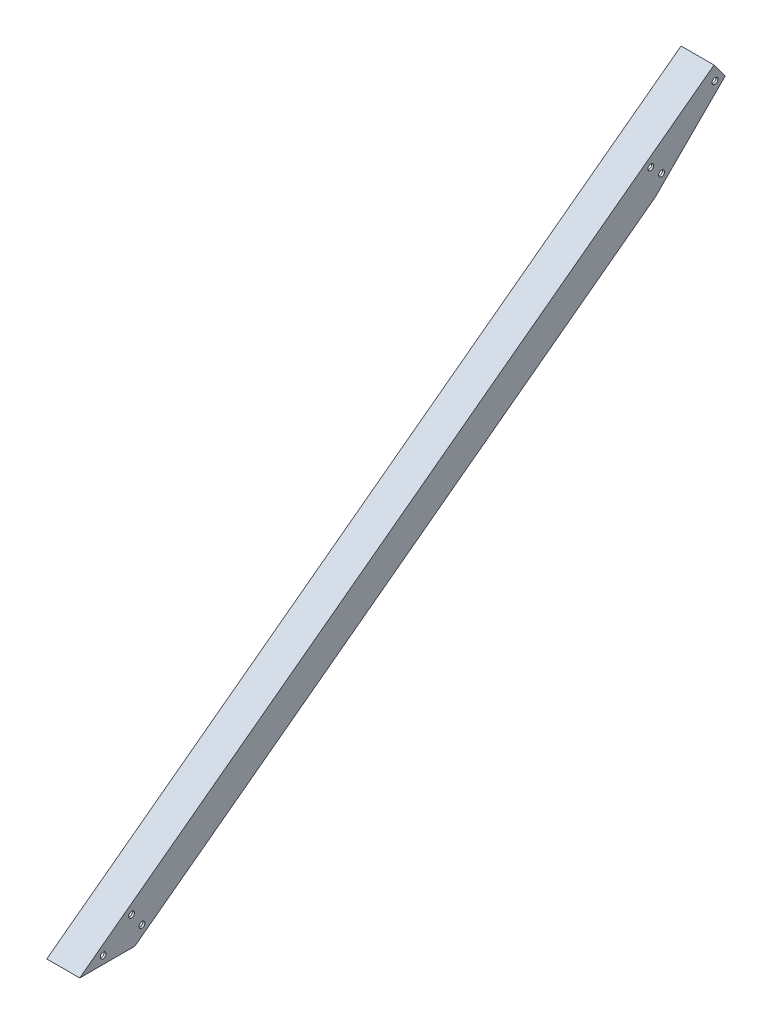
ISO-10303-21;
HEADER;
FILE_DESCRIPTION(('STEP AP214'),'2;1');
FILE_NAME('part.step','',(''),(''),'','','');
FILE_SCHEMA(('AUTOMOTIVE_DESIGN { 1 0 10303 214 1 1 1 1 }'));
ENDSEC;
DATA;
#1=APPLICATION_CONTEXT('core data for automotive mechanical design processes');
#2=APPLICATION_PROTOCOL_DEFINITION('international standard','automotive_design',2000,#1);
#3=PRODUCT_CONTEXT('',#1,'mechanical');
#4=PRODUCT('Part','Part','',(#3));
#5=PRODUCT_RELATED_PRODUCT_CATEGORY('part','',(#4));
#6=PRODUCT_DEFINITION_FORMATION('','',#4);
#7=PRODUCT_DEFINITION_CONTEXT('part definition',#1,'design');
#8=PRODUCT_DEFINITION('design','',#6,#7);
#9=PRODUCT_DEFINITION_SHAPE('','',#8);
#10=(LENGTH_UNIT() NAMED_UNIT(*) SI_UNIT(.MILLI.,.METRE.));
#11=(NAMED_UNIT(*) PLANE_ANGLE_UNIT() SI_UNIT($,.RADIAN.));
#12=(NAMED_UNIT(*) SI_UNIT($,.STERADIAN.) SOLID_ANGLE_UNIT());
#13=UNCERTAINTY_MEASURE_WITH_UNIT(LENGTH_MEASURE(1.E-05),#10,'distance_accuracy_value','');
#14=(GEOMETRIC_REPRESENTATION_CONTEXT(3) GLOBAL_UNCERTAINTY_ASSIGNED_CONTEXT((#13)) GLOBAL_UNIT_ASSIGNED_CONTEXT((#10,
#11,#12)) REPRESENTATION_CONTEXT('',''));
#15=CARTESIAN_POINT('',(0.,0.,0.));
#16=DIRECTION('',(0.,0.,1.));
#17=DIRECTION('',(1.,0.,0.));
#18=AXIS2_PLACEMENT_3D('',#15,#16,#17);
#19=CARTESIAN_POINT('',(114.3,-46.6394877578616,-46.6394877578611));
#20=DIRECTION('',(0.,0.707106781186551,0.707106781186544));
#21=DIRECTION('',(0.,-0.707106781186544,0.707106781186551));
#22=AXIS2_PLACEMENT_3D('',#19,#20,#21);
#23=PLANE('',#22);
#24=DIRECTION('',(0.,0.707106781186544,-0.707106781186551));
#25=VECTOR('',#24,1.);
#26=CARTESIAN_POINT('',(90.4875,-46.6394877578616,-46.6394877578611));
#27=LINE('',#26,#25);
#28=CARTESIAN_POINT('',(90.4875,332.446060333932,-425.725035849659));
#29=VERTEX_POINT('',#28);
#30=CARTESIAN_POINT('',(90.4875,378.473402548094,-471.752378063822));
#31=VERTEX_POINT('',#30);
#32=EDGE_CURVE('E131',#29,#31,#27,.T.);
#33=ORIENTED_EDGE('',*,*,#32,.F.);
#34=DIRECTION('',(1.,0.,0.));
#35=VECTOR('',#34,1.);
#36=CARTESIAN_POINT('',(114.3,332.446060333932,-425.725035849658));
#37=LINE('',#36,#35);
#38=CARTESIAN_POINT('',(112.7125,332.446060333928,-425.725035849653));
#39=VERTEX_POINT('',#38);
#40=EDGE_CURVE('E153',#29,#39,#37,.T.);
#41=ORIENTED_EDGE('',*,*,#40,.T.);
#42=DIRECTION('',(0.,0.707106781186544,-0.707106781186551));
#43=VECTOR('',#42,1.);
#44=CARTESIAN_POINT('',(112.7125,-46.6394877578616,-46.6394877578611));
#45=LINE('',#44,#43);
#46=CARTESIAN_POINT('',(112.7125,378.473402548094,-471.752378063822));
#47=VERTEX_POINT('',#46);
#48=EDGE_CURVE('E123',#39,#47,#45,.T.);
#49=ORIENTED_EDGE('',*,*,#48,.T.);
#50=DIRECTION('',(-1.,0.,0.));
#51=VECTOR('',#50,1.);
#52=CARTESIAN_POINT('',(114.3,378.473402548094,-471.752378063821));
#53=LINE('',#52,#51);
#54=CARTESIAN_POINT('',(114.3,378.473402548094,-471.752378063821));
#55=VERTEX_POINT('',#54);
#56=EDGE_CURVE('E192',#55,#47,#53,.T.);
#57=ORIENTED_EDGE('',*,*,#56,.F.);
#58=DIRECTION('',(0.,0.707106781186544,-0.707106781186551));
#59=VECTOR('',#58,1.);
#60=CARTESIAN_POINT('',(114.3,-46.6394877578616,-46.6394877578611));
#61=LINE('',#60,#59);
#62=CARTESIAN_POINT('',(114.3,324.631526442067,-417.910501957793));
#63=VERTEX_POINT('',#62);
#64=EDGE_CURVE('E158',#63,#55,#61,.T.);
#65=ORIENTED_EDGE('',*,*,#64,.F.);
#66=DIRECTION('',(-1.,0.,0.));
#67=VECTOR('',#66,1.);
#68=CARTESIAN_POINT('',(114.3,324.631526442067,-417.910501957793));
#69=LINE('',#68,#67);
#70=CARTESIAN_POINT('',(88.9,324.631526442067,-417.910501957793));
#71=VERTEX_POINT('',#70);
#72=EDGE_CURVE('E170',#63,#71,#69,.T.);
#73=ORIENTED_EDGE('',*,*,#72,.T.);
#74=DIRECTION('',(0.,0.707106781186544,-0.707106781186551));
#75=VECTOR('',#74,1.);
#76=CARTESIAN_POINT('',(88.9,-46.6394877578616,-46.6394877578611));
#77=LINE('',#76,#75);
#78=CARTESIAN_POINT('',(88.9,378.473402548094,-471.752378063821));
#79=VERTEX_POINT('',#78);
#80=EDGE_CURVE('E157',#71,#79,#77,.T.);
#81=ORIENTED_EDGE('',*,*,#80,.T.);
#82=EDGE_CURVE('E191',#31,#79,#53,.T.);
#83=ORIENTED_EDGE('',*,*,#82,.F.);
#84=EDGE_LOOP('',(#33,#41,#49,#57,#65,#73,#81,#83));
#85=FACE_BOUND('',#84,.T.);
#86=ADVANCED_FACE('F41',(#85),#23,.F.);
#87=CARTESIAN_POINT('',(114.3,361.575951818807,-484.366205698519));
#88=DIRECTION('',(0.,-0.59819984437787,0.801346957432479));
#89=DIRECTION('',(0.,-0.801346957432479,-0.59819984437787));
#90=AXIS2_PLACEMENT_3D('',#87,#88,#89);
#91=PLANE('',#90);
#92=DIRECTION('',(0.,-0.80134695743248,-0.59819984437787));
#93=VECTOR('',#92,1.);
#94=CARTESIAN_POINT('',(90.4875,361.575951818806,-484.366205698519));
#95=LINE('',#94,#93);
#96=CARTESIAN_POINT('',(90.4875,388.790486837825,-464.05074750379));
#97=VERTEX_POINT('',#96);
#98=EDGE_CURVE('E127',#97,#31,#95,.T.);
#99=ORIENTED_EDGE('',*,*,#98,.T.);
#100=ORIENTED_EDGE('',*,*,#82,.T.);
#101=DIRECTION('',(0.,0.801346957432479,0.59819984437787));
#102=VECTOR('',#101,1.);
#103=CARTESIAN_POINT('',(88.9,361.575951818807,-484.366205698519));
#104=LINE('',#103,#102);
#105=CARTESIAN_POINT('',(88.9,390.062625132749,-463.10110525084));
#106=VERTEX_POINT('',#105);
#107=EDGE_CURVE('E173',#79,#106,#104,.T.);
#108=ORIENTED_EDGE('',*,*,#107,.T.);
#109=DIRECTION('',(-1.,0.,0.));
#110=VECTOR('',#109,1.);
#111=CARTESIAN_POINT('',(114.3,390.062625132749,-463.10110525084));
#112=LINE('',#111,#110);
#113=CARTESIAN_POINT('',(114.3,390.062625132749,-463.10110525084));
#114=VERTEX_POINT('',#113);
#115=EDGE_CURVE('E188',#114,#106,#112,.T.);
#116=ORIENTED_EDGE('',*,*,#115,.F.);
#117=DIRECTION('',(0.,0.801346957432479,0.59819984437787));
#118=VECTOR('',#117,1.);
#119=CARTESIAN_POINT('',(114.3,361.575951818807,-484.366205698519));
#120=LINE('',#119,#118);
#121=EDGE_CURVE('E161',#55,#114,#120,.T.);
#122=ORIENTED_EDGE('',*,*,#121,.F.);
#123=ORIENTED_EDGE('',*,*,#56,.T.);
#124=DIRECTION('',(0.,-0.80134695743248,-0.59819984437787));
#125=VECTOR('',#124,1.);
#126=CARTESIAN_POINT('',(112.7125,361.575951818806,-484.366205698519));
#127=LINE('',#126,#125);
#128=CARTESIAN_POINT('',(112.7125,388.790486837825,-464.05074750379));
#129=VERTEX_POINT('',#128);
#130=EDGE_CURVE('E135',#129,#47,#127,.T.);
#131=ORIENTED_EDGE('',*,*,#130,.F.);
#132=DIRECTION('',(-1.,0.,0.));
#133=VECTOR('',#132,1.);
#134=CARTESIAN_POINT('',(-4.19414547070682E-13,388.790486837825,-464.05074750379));
#135=LINE('',#134,#133);
#136=EDGE_CURVE('E57',#129,#97,#135,.T.);
#137=ORIENTED_EDGE('',*,*,#136,.T.);
#138=EDGE_LOOP('',(#99,#100,#108,#116,#122,#123,#131,#137));
#139=FACE_BOUND('',#138,.T.);
#140=ADVANCED_FACE('F138',(#139),#91,.F.);
#141=CARTESIAN_POINT('',(114.3,25.4000000000001,0.));
#142=DIRECTION('',(0.,1.,0.));
#143=DIRECTION('',(0.,0.,1.));
#144=AXIS2_PLACEMENT_3D('',#141,#142,#143);
#145=PLANE('',#144);
#146=DIRECTION('',(0.,0.,-1.));
#147=VECTOR('',#146,1.);
#148=CARTESIAN_POINT('',(88.9,25.4000000000001,0.));
#149=LINE('',#148,#147);
#150=CARTESIAN_POINT('',(88.9,25.4,25.4));
#151=VERTEX_POINT('',#150);
#152=CARTESIAN_POINT('',(88.9,25.4000000000001,-17.0607265259594));
#153=VERTEX_POINT('',#152);
#154=EDGE_CURVE('E177',#151,#153,#149,.T.);
#155=ORIENTED_EDGE('',*,*,#154,.T.);
#156=DIRECTION('',(-1.,0.,0.));
#157=VECTOR('',#156,1.);
#158=CARTESIAN_POINT('',(114.3,25.4000000000001,-17.0607265259594));
#159=LINE('',#158,#157);
#160=CARTESIAN_POINT('',(114.3,25.4000000000001,-17.0607265259594));
#161=VERTEX_POINT('',#160);
#162=EDGE_CURVE('E182',#161,#153,#159,.T.);
#163=ORIENTED_EDGE('',*,*,#162,.F.);
#164=DIRECTION('',(0.,0.,-1.));
#165=VECTOR('',#164,1.);
#166=CARTESIAN_POINT('',(114.3,25.4000000000001,0.));
#167=LINE('',#166,#165);
#168=CARTESIAN_POINT('',(114.3,25.4,25.4));
#169=VERTEX_POINT('',#168);
#170=EDGE_CURVE('E166',#169,#161,#167,.T.);
#171=ORIENTED_EDGE('',*,*,#170,.F.);
#172=DIRECTION('',(-1.,0.,0.));
#173=VECTOR('',#172,1.);
#174=CARTESIAN_POINT('',(114.3,25.4,25.4));
#175=LINE('',#174,#173);
#176=EDGE_CURVE('E185',#169,#151,#175,.T.);
#177=ORIENTED_EDGE('',*,*,#176,.T.);
#178=EDGE_LOOP('',(#155,#163,#171,#177));
#179=FACE_BOUND('',#178,.T.);
#180=DIRECTION('',(-1.,0.,0.));
#181=VECTOR('',#180,1.);
#182=CARTESIAN_POINT('',(114.3,25.4,22.746204592126));
#183=LINE('',#182,#181);
#184=CARTESIAN_POINT('',(112.7125,25.4,22.7462045921258));
#185=VERTEX_POINT('',#184);
#186=CARTESIAN_POINT('',(90.4875,25.4,22.7462045921258));
#187=VERTEX_POINT('',#186);
#188=EDGE_CURVE('E11',#185,#187,#183,.T.);
#189=ORIENTED_EDGE('',*,*,#188,.F.);
#190=DIRECTION('',(0.,0.,-1.));
#191=VECTOR('',#190,1.);
#192=CARTESIAN_POINT('',(112.7125,25.4000000000001,0.));
#193=LINE('',#192,#191);
#194=CARTESIAN_POINT('',(112.7125,25.4000000000002,-14.4069311180883));
#195=VERTEX_POINT('',#194);
#196=EDGE_CURVE('E194',#185,#195,#193,.T.);
#197=ORIENTED_EDGE('',*,*,#196,.T.);
#198=DIRECTION('',(-1.,0.,0.));
#199=VECTOR('',#198,1.);
#200=CARTESIAN_POINT('',(114.3,25.4000000000001,-14.4069311180882));
#201=LINE('',#200,#199);
#202=CARTESIAN_POINT('',(90.4875,25.4000000000004,-14.4069311180886));
#203=VERTEX_POINT('',#202);
#204=EDGE_CURVE('E197',#195,#203,#201,.T.);
#205=ORIENTED_EDGE('',*,*,#204,.T.);
#206=DIRECTION('',(0.,0.,-1.));
#207=VECTOR('',#206,1.);
#208=CARTESIAN_POINT('',(90.4875,25.4000000000001,0.));
#209=LINE('',#208,#207);
#210=EDGE_CURVE('E49',#187,#203,#209,.T.);
#211=ORIENTED_EDGE('',*,*,#210,.F.);
#212=EDGE_LOOP('',(#189,#197,#205,#211));
#213=FACE_BOUND('',#212,.T.);
#214=ADVANCED_FACE('F273',(#179,#213),#145,.F.);
#215=CARTESIAN_POINT('',(114.3,28.486673313943,21.2651004476793));
#216=DIRECTION('',(0.,-0.80134695743248,-0.598199844377869));
#217=DIRECTION('',(0.,0.598199844377869,-0.80134695743248));
#218=AXIS2_PLACEMENT_3D('',#215,#216,#217);
#219=PLANE('',#218);
#220=DIRECTION('',(0.,-0.598199844377869,0.80134695743248));
#221=VECTOR('',#220,1.);
#222=CARTESIAN_POINT('',(88.9,28.486673313943,21.2651004476793));
#223=LINE('',#222,#221);
#224=EDGE_CURVE('E175',#106,#151,#223,.T.);
#225=ORIENTED_EDGE('',*,*,#224,.T.);
#226=ORIENTED_EDGE('',*,*,#176,.F.);
#227=DIRECTION('',(0.,-0.598199844377869,0.80134695743248));
#228=VECTOR('',#227,1.);
#229=CARTESIAN_POINT('',(114.3,28.486673313943,21.2651004476793));
#230=LINE('',#229,#228);
#231=EDGE_CURVE('E164',#114,#169,#230,.T.);
#232=ORIENTED_EDGE('',*,*,#231,.F.);
#233=ORIENTED_EDGE('',*,*,#115,.T.);
#234=EDGE_LOOP('',(#225,#226,#232,#233));
#235=FACE_BOUND('',#234,.T.);
#236=ADVANCED_FACE('F284',(#235),#219,.F.);
#237=CARTESIAN_POINT('',(114.3,8.13246059515802,6.07082440048146));
#238=DIRECTION('',(0.,0.80134695743248,0.598199844377869));
#239=DIRECTION('',(0.,-0.598199844377869,0.80134695743248));
#240=AXIS2_PLACEMENT_3D('',#237,#238,#239);
#241=PLANE('',#240);
#242=DIRECTION('',(0.,0.598199844377869,-0.80134695743248));
#243=VECTOR('',#242,1.);
#244=CARTESIAN_POINT('',(88.9,8.13246059515802,6.07082440048146));
#245=LINE('',#244,#243);
#246=EDGE_CURVE('E162',#153,#71,#245,.T.);
#247=ORIENTED_EDGE('',*,*,#246,.T.);
#248=ORIENTED_EDGE('',*,*,#72,.F.);
#249=DIRECTION('',(0.,0.598199844377869,-0.80134695743248));
#250=VECTOR('',#249,1.);
#251=CARTESIAN_POINT('',(114.3,8.13246059515802,6.07082440048146));
#252=LINE('',#251,#250);
#253=EDGE_CURVE('E168',#161,#63,#252,.T.);
#254=ORIENTED_EDGE('',*,*,#253,.F.);
#255=ORIENTED_EDGE('',*,*,#162,.T.);
#256=EDGE_LOOP('',(#247,#248,#254,#255));
#257=FACE_BOUND('',#256,.T.);
#258=ADVANCED_FACE('F305',(#257),#241,.F.);
#259=CARTESIAN_POINT('',(114.3,0.,0.));
#260=DIRECTION('',(1.,0.,0.));
#261=DIRECTION('',(0.,0.,-1.));
#262=AXIS2_PLACEMENT_3D('',#259,#260,#261);
#263=PLANE('',#262);
#264=CARTESIAN_POINT('',(114.3,379.044769229918,-463.838463371403));
#265=DIRECTION('',(1.,0.,0.));
#266=DIRECTION('',(0.,0.,-1.));
#267=AXIS2_PLACEMENT_3D('',#264,#265,#266);
#268=CIRCLE('',#267,2.24999999999996);
#269=CARTESIAN_POINT('',(114.3,379.044769229918,-466.088463371403));
#270=VERTEX_POINT('',#269);
#271=EDGE_CURVE('E404',#270,#270,#268,.T.);
#272=ORIENTED_EDGE('',*,*,#271,.F.);
#273=EDGE_LOOP('',(#272));
#274=FACE_BOUND('',#273,.T.);
#275=CARTESIAN_POINT('',(114.3,346.244088463268,-414.432000247125));
#276=DIRECTION('',(1.,0.,0.));
#277=DIRECTION('',(0.,0.,-1.));
#278=AXIS2_PLACEMENT_3D('',#275,#276,#277);
#279=CIRCLE('',#278,2.25000000000001);
#280=CARTESIAN_POINT('',(114.3,346.244088463268,-416.682000247125));
#281=VERTEX_POINT('',#280);
#282=EDGE_CURVE('E402',#281,#281,#279,.T.);
#283=ORIENTED_EDGE('',*,*,#282,.F.);
#284=EDGE_LOOP('',(#283));
#285=FACE_BOUND('',#284,.T.);
#286=CARTESIAN_POINT('',(114.3,337.941197284456,-422.734891425937));
#287=DIRECTION('',(1.,0.,0.));
#288=DIRECTION('',(0.,0.,-1.));
#289=AXIS2_PLACEMENT_3D('',#286,#287,#288);
#290=CIRCLE('',#289,2.24999999999996);
#291=CARTESIAN_POINT('',(114.3,337.941197284456,-424.984891425937));
#292=VERTEX_POINT('',#291);
#293=EDGE_CURVE('E397',#292,#292,#290,.T.);
#294=ORIENTED_EDGE('',*,*,#293,.F.);
#295=EDGE_LOOP('',(#294));
#296=FACE_BOUND('',#295,.T.);
#297=CARTESIAN_POINT('',(114.3,31.4,7.33232270758054));
#298=DIRECTION('',(1.,0.,0.));
#299=DIRECTION('',(0.,0.,-1.));
#300=AXIS2_PLACEMENT_3D('',#297,#298,#299);
#301=CIRCLE('',#300,2.25);
#302=CARTESIAN_POINT('',(114.3,31.4,5.08232270758054));
#303=VERTEX_POINT('',#302);
#304=EDGE_CURVE('E378',#303,#303,#301,.T.);
#305=ORIENTED_EDGE('',*,*,#304,.F.);
#306=EDGE_LOOP('',(#305));
#307=FACE_BOUND('',#306,.T.);
#308=CARTESIAN_POINT('',(114.3,47.6821192037804,-14.4791618775951));
#309=DIRECTION('',(1.,0.,0.));
#310=DIRECTION('',(0.,0.,-1.));
#311=AXIS2_PLACEMENT_3D('',#308,#309,#310);
#312=CIRCLE('',#311,2.25);
#313=CARTESIAN_POINT('',(114.3,47.6821192037804,-16.7291618775951));
#314=VERTEX_POINT('',#313);
#315=EDGE_CURVE('E393',#314,#314,#312,.T.);
#316=ORIENTED_EDGE('',*,*,#315,.F.);
#317=EDGE_LOOP('',(#316));
#318=FACE_BOUND('',#317,.T.);
#319=CARTESIAN_POINT('',(114.3,36.9440699741851,-22.4950397922586));
#320=DIRECTION('',(1.,0.,0.));
#321=DIRECTION('',(0.,0.,-1.));
#322=AXIS2_PLACEMENT_3D('',#319,#320,#321);
#323=CIRCLE('',#322,2.25);
#324=CARTESIAN_POINT('',(114.3,36.9440699741851,-24.7450397922586));
#325=VERTEX_POINT('',#324);
#326=EDGE_CURVE('E205',#325,#325,#323,.T.);
#327=ORIENTED_EDGE('',*,*,#326,.F.);
#328=EDGE_LOOP('',(#327));
#329=FACE_BOUND('',#328,.T.);
#330=ORIENTED_EDGE('',*,*,#64,.T.);
#331=ORIENTED_EDGE('',*,*,#121,.T.);
#332=ORIENTED_EDGE('',*,*,#231,.T.);
#333=ORIENTED_EDGE('',*,*,#170,.T.);
#334=ORIENTED_EDGE('',*,*,#253,.T.);
#335=EDGE_LOOP('',(#330,#331,#332,#333,#334));
#336=FACE_BOUND('',#335,.T.);
#337=ADVANCED_FACE('F292',(#274,#285,#296,#307,#318,#329,#336),#263,.T.);
#338=CARTESIAN_POINT('',(88.9,0.,0.));
#339=DIRECTION('',(1.,0.,0.));
#340=DIRECTION('',(0.,0.,-1.));
#341=AXIS2_PLACEMENT_3D('',#338,#339,#340);
#342=PLANE('',#341);
#343=CARTESIAN_POINT('',(88.9,379.044769229918,-463.838463371403));
#344=DIRECTION('',(1.,0.,0.));
#345=DIRECTION('',(0.,0.,-1.));
#346=AXIS2_PLACEMENT_3D('',#343,#344,#345);
#347=CIRCLE('',#346,2.24999999999996);
#348=CARTESIAN_POINT('',(88.9,379.044769229918,-466.088463371403));
#349=VERTEX_POINT('',#348);
#350=EDGE_CURVE('E140',#349,#349,#347,.T.);
#351=ORIENTED_EDGE('',*,*,#350,.T.);
#352=EDGE_LOOP('',(#351));
#353=FACE_BOUND('',#352,.T.);
#354=CARTESIAN_POINT('',(88.9,346.244088463268,-414.432000247125));
#355=DIRECTION('',(1.,0.,0.));
#356=DIRECTION('',(0.,0.,-1.));
#357=AXIS2_PLACEMENT_3D('',#354,#355,#356);
#358=CIRCLE('',#357,2.25000000000001);
#359=CARTESIAN_POINT('',(88.9,346.244088463268,-416.682000247125));
#360=VERTEX_POINT('',#359);
#361=EDGE_CURVE('E227',#360,#360,#358,.T.);
#362=ORIENTED_EDGE('',*,*,#361,.T.);
#363=EDGE_LOOP('',(#362));
#364=FACE_BOUND('',#363,.T.);
#365=CARTESIAN_POINT('',(88.9,337.941197284456,-422.734891425937));
#366=DIRECTION('',(1.,0.,0.));
#367=DIRECTION('',(0.,0.,-1.));
#368=AXIS2_PLACEMENT_3D('',#365,#366,#367);
#369=CIRCLE('',#368,2.24999999999996);
#370=CARTESIAN_POINT('',(88.9,337.941197284456,-424.984891425937));
#371=VERTEX_POINT('',#370);
#372=EDGE_CURVE('E223',#371,#371,#369,.T.);
#373=ORIENTED_EDGE('',*,*,#372,.T.);
#374=EDGE_LOOP('',(#373));
#375=FACE_BOUND('',#374,.T.);
#376=CARTESIAN_POINT('',(88.9,31.4,7.33232270758054));
#377=DIRECTION('',(1.,0.,0.));
#378=DIRECTION('',(0.,0.,-1.));
#379=AXIS2_PLACEMENT_3D('',#376,#377,#378);
#380=CIRCLE('',#379,2.25);
#381=CARTESIAN_POINT('',(88.9,31.4,5.08232270758054));
#382=VERTEX_POINT('',#381);
#383=EDGE_CURVE('E219',#382,#382,#380,.T.);
#384=ORIENTED_EDGE('',*,*,#383,.T.);
#385=EDGE_LOOP('',(#384));
#386=FACE_BOUND('',#385,.T.);
#387=CARTESIAN_POINT('',(88.9,47.6821192037804,-14.4791618775951));
#388=DIRECTION('',(1.,0.,0.));
#389=DIRECTION('',(0.,0.,-1.));
#390=AXIS2_PLACEMENT_3D('',#387,#388,#389);
#391=CIRCLE('',#390,2.25);
#392=CARTESIAN_POINT('',(88.9,47.6821192037804,-16.7291618775951));
#393=VERTEX_POINT('',#392);
#394=EDGE_CURVE('E215',#393,#393,#391,.T.);
#395=ORIENTED_EDGE('',*,*,#394,.T.);
#396=EDGE_LOOP('',(#395));
#397=FACE_BOUND('',#396,.T.);
#398=CARTESIAN_POINT('',(88.9,36.9440699741851,-22.4950397922586));
#399=DIRECTION('',(1.,0.,0.));
#400=DIRECTION('',(0.,0.,-1.));
#401=AXIS2_PLACEMENT_3D('',#398,#399,#400);
#402=CIRCLE('',#401,2.25);
#403=CARTESIAN_POINT('',(88.9,36.9440699741851,-24.7450397922586));
#404=VERTEX_POINT('',#403);
#405=EDGE_CURVE('E210',#404,#404,#402,.T.);
#406=ORIENTED_EDGE('',*,*,#405,.T.);
#407=EDGE_LOOP('',(#406));
#408=FACE_BOUND('',#407,.T.);
#409=ORIENTED_EDGE('',*,*,#80,.F.);
#410=ORIENTED_EDGE('',*,*,#246,.F.);
#411=ORIENTED_EDGE('',*,*,#154,.F.);
#412=ORIENTED_EDGE('',*,*,#224,.F.);
#413=ORIENTED_EDGE('',*,*,#107,.F.);
#414=EDGE_LOOP('',(#409,#410,#411,#412,#413));
#415=FACE_BOUND('',#414,.T.);
#416=ADVANCED_FACE('F279',(#353,#364,#375,#386,#397,#408,#415),#342,.F.);
#417=CARTESIAN_POINT('',(-4.19414547070682E-13,-807.609201917915,1138.64316736117));
#418=DIRECTION('',(0.,-0.80134695743248,-0.59819984437787));
#419=DIRECTION('',(0.,0.59819984437787,-0.80134695743248));
#420=AXIS2_PLACEMENT_3D('',#417,#418,#419);
#421=PLANE('',#420);
#422=ORIENTED_EDGE('',*,*,#188,.T.);
#423=DIRECTION('',(0.,0.59819984437787,-0.80134695743248));
#424=VECTOR('',#423,1.);
#425=CARTESIAN_POINT('',(90.4875,-807.609201917915,1138.64316736117));
#426=LINE('',#425,#424);
#427=EDGE_CURVE('E117',#187,#97,#426,.T.);
#428=ORIENTED_EDGE('',*,*,#427,.T.);
#429=ORIENTED_EDGE('',*,*,#136,.F.);
#430=DIRECTION('',(0.,0.59819984437787,-0.80134695743248));
#431=VECTOR('',#430,1.);
#432=CARTESIAN_POINT('',(112.7125,-807.609201917915,1138.64316736117));
#433=LINE('',#432,#431);
#434=EDGE_CURVE('E134',#185,#129,#433,.T.);
#435=ORIENTED_EDGE('',*,*,#434,.F.);
#436=EDGE_LOOP('',(#422,#428,#429,#435));
#437=FACE_BOUND('',#436,.T.);
#438=ADVANCED_FACE('F119',(#437),#421,.T.);
#439=CARTESIAN_POINT('',(90.4875,-834.823736936934,1118.32770916644));
#440=DIRECTION('',(1.,0.,0.));
#441=DIRECTION('',(0.,0.,-1.));
#442=AXIS2_PLACEMENT_3D('',#439,#440,#441);
#443=PLANE('',#442);
#444=CARTESIAN_POINT('',(90.4875000000001,379.044769229918,-463.838463371403));
#445=DIRECTION('',(1.,0.,0.));
#446=DIRECTION('',(0.,0.,-1.));
#447=AXIS2_PLACEMENT_3D('',#444,#445,#446);
#448=CIRCLE('',#447,2.24999999999996);
#449=CARTESIAN_POINT('',(90.4875000000001,379.044769229918,-466.088463371403));
#450=VERTEX_POINT('',#449);
#451=EDGE_CURVE('E144',#450,#450,#448,.T.);
#452=ORIENTED_EDGE('',*,*,#451,.F.);
#453=EDGE_LOOP('',(#452));
#454=FACE_BOUND('',#453,.T.);
#455=CARTESIAN_POINT('',(90.4875000000001,346.244088463268,-414.432000247125));
#456=DIRECTION('',(1.,0.,0.));
#457=DIRECTION('',(0.,0.,-1.));
#458=AXIS2_PLACEMENT_3D('',#455,#456,#457);
#459=CIRCLE('',#458,2.25000000000001);
#460=CARTESIAN_POINT('',(90.4875000000001,346.244088463268,-416.682000247125));
#461=VERTEX_POINT('',#460);
#462=EDGE_CURVE('E222',#461,#461,#459,.T.);
#463=ORIENTED_EDGE('',*,*,#462,.F.);
#464=EDGE_LOOP('',(#463));
#465=FACE_BOUND('',#464,.T.);
#466=CARTESIAN_POINT('',(90.4875000000001,337.941197284456,-422.734891425937));
#467=DIRECTION('',(1.,0.,0.));
#468=DIRECTION('',(0.,0.,-1.));
#469=AXIS2_PLACEMENT_3D('',#466,#467,#468);
#470=CIRCLE('',#469,2.24999999999996);
#471=CARTESIAN_POINT('',(90.4875000000001,337.941197284456,-424.984891425937));
#472=VERTEX_POINT('',#471);
#473=EDGE_CURVE('E218',#472,#472,#470,.T.);
#474=ORIENTED_EDGE('',*,*,#473,.F.);
#475=EDGE_LOOP('',(#474));
#476=FACE_BOUND('',#475,.T.);
#477=CARTESIAN_POINT('',(90.4875000000001,31.4,7.33232270758054));
#478=DIRECTION('',(1.,0.,0.));
#479=DIRECTION('',(0.,0.,-1.));
#480=AXIS2_PLACEMENT_3D('',#477,#478,#479);
#481=CIRCLE('',#480,2.25);
#482=CARTESIAN_POINT('',(90.4875000000001,31.4,5.08232270758054));
#483=VERTEX_POINT('',#482);
#484=EDGE_CURVE('E214',#483,#483,#481,.T.);
#485=ORIENTED_EDGE('',*,*,#484,.F.);
#486=EDGE_LOOP('',(#485));
#487=FACE_BOUND('',#486,.T.);
#488=CARTESIAN_POINT('',(90.4875000000001,47.6821192037804,-14.4791618775951));
#489=DIRECTION('',(1.,0.,0.));
#490=DIRECTION('',(0.,0.,-1.));
#491=AXIS2_PLACEMENT_3D('',#488,#489,#490);
#492=CIRCLE('',#491,2.25);
#493=CARTESIAN_POINT('',(90.4875000000001,47.6821192037804,-16.7291618775951));
#494=VERTEX_POINT('',#493);
#495=EDGE_CURVE('E209',#494,#494,#492,.T.);
#496=ORIENTED_EDGE('',*,*,#495,.F.);
#497=EDGE_LOOP('',(#496));
#498=FACE_BOUND('',#497,.T.);
#499=CARTESIAN_POINT('',(90.4875000000001,36.9440699741851,-22.4950397922586));
#500=DIRECTION('',(1.,0.,0.));
#501=DIRECTION('',(0.,0.,-1.));
#502=AXIS2_PLACEMENT_3D('',#499,#500,#501);
#503=CIRCLE('',#502,2.25);
#504=CARTESIAN_POINT('',(90.4875000000001,36.9440699741851,-24.7450397922586));
#505=VERTEX_POINT('',#504);
#506=EDGE_CURVE('E204',#505,#505,#503,.T.);
#507=ORIENTED_EDGE('',*,*,#506,.F.);
#508=EDGE_LOOP('',(#507));
#509=FACE_BOUND('',#508,.T.);
#510=ORIENTED_EDGE('',*,*,#32,.T.);
#511=ORIENTED_EDGE('',*,*,#98,.F.);
#512=ORIENTED_EDGE('',*,*,#427,.F.);
#513=ORIENTED_EDGE('',*,*,#210,.T.);
#514=DIRECTION('',(0.,0.59819984437787,-0.80134695743248));
#515=VECTOR('',#514,1.);
#516=CARTESIAN_POINT('',(90.4875,-825.419138046852,1125.34817581987));
#517=LINE('',#516,#515);
#518=EDGE_CURVE('E124',#203,#29,#517,.T.);
#519=ORIENTED_EDGE('',*,*,#518,.T.);
#520=EDGE_LOOP('',(#510,#511,#512,#513,#519));
#521=FACE_BOUND('',#520,.T.);
#522=ADVANCED_FACE('F128',(#454,#465,#476,#487,#498,#509,#521),#443,.T.);
#523=CARTESIAN_POINT('',(-4.19414547070682E-13,-825.419138046852,1125.34817581987));
#524=DIRECTION('',(0.,-0.80134695743248,-0.59819984437787));
#525=DIRECTION('',(0.,0.59819984437787,-0.80134695743248));
#526=AXIS2_PLACEMENT_3D('',#523,#524,#525);
#527=PLANE('',#526);
#528=ORIENTED_EDGE('',*,*,#518,.F.);
#529=ORIENTED_EDGE('',*,*,#204,.F.);
#530=DIRECTION('',(0.,0.59819984437787,-0.80134695743248));
#531=VECTOR('',#530,1.);
#532=CARTESIAN_POINT('',(112.7125,-825.419138046852,1125.34817581987));
#533=LINE('',#532,#531);
#534=EDGE_CURVE('E65',#195,#39,#533,.T.);
#535=ORIENTED_EDGE('',*,*,#534,.T.);
#536=ORIENTED_EDGE('',*,*,#40,.F.);
#537=EDGE_LOOP('',(#528,#529,#535,#536));
#538=FACE_BOUND('',#537,.T.);
#539=ADVANCED_FACE('F298',(#538),#527,.F.);
#540=CARTESIAN_POINT('',(112.7125,-834.823736936934,1118.32770916644));
#541=DIRECTION('',(1.,0.,0.));
#542=DIRECTION('',(0.,0.,-1.));
#543=AXIS2_PLACEMENT_3D('',#540,#541,#542);
#544=PLANE('',#543);
#545=CARTESIAN_POINT('',(112.7125,379.044769229918,-463.838463371403));
#546=DIRECTION('',(1.,0.,0.));
#547=DIRECTION('',(0.,0.,-1.));
#548=AXIS2_PLACEMENT_3D('',#545,#546,#547);
#549=CIRCLE('',#548,2.24999999999996);
#550=CARTESIAN_POINT('',(112.7125,379.044769229918,-466.088463371403));
#551=VERTEX_POINT('',#550);
#552=EDGE_CURVE('E44',#551,#551,#549,.T.);
#553=ORIENTED_EDGE('',*,*,#552,.T.);
#554=EDGE_LOOP('',(#553));
#555=FACE_BOUND('',#554,.T.);
#556=CARTESIAN_POINT('',(112.7125,346.244088463268,-414.432000247125));
#557=DIRECTION('',(1.,0.,0.));
#558=DIRECTION('',(0.,0.,-1.));
#559=AXIS2_PLACEMENT_3D('',#556,#557,#558);
#560=CIRCLE('',#559,2.25000000000001);
#561=CARTESIAN_POINT('',(112.7125,346.244088463268,-416.682000247125));
#562=VERTEX_POINT('',#561);
#563=EDGE_CURVE('E220',#562,#562,#560,.T.);
#564=ORIENTED_EDGE('',*,*,#563,.T.);
#565=EDGE_LOOP('',(#564));
#566=FACE_BOUND('',#565,.T.);
#567=CARTESIAN_POINT('',(112.7125,337.941197284456,-422.734891425937));
#568=DIRECTION('',(1.,0.,0.));
#569=DIRECTION('',(0.,0.,-1.));
#570=AXIS2_PLACEMENT_3D('',#567,#568,#569);
#571=CIRCLE('',#570,2.24999999999996);
#572=CARTESIAN_POINT('',(112.7125,337.941197284456,-424.984891425937));
#573=VERTEX_POINT('',#572);
#574=EDGE_CURVE('E216',#573,#573,#571,.T.);
#575=ORIENTED_EDGE('',*,*,#574,.T.);
#576=EDGE_LOOP('',(#575));
#577=FACE_BOUND('',#576,.T.);
#578=CARTESIAN_POINT('',(112.7125,31.4,7.33232270758054));
#579=DIRECTION('',(1.,0.,0.));
#580=DIRECTION('',(0.,0.,-1.));
#581=AXIS2_PLACEMENT_3D('',#578,#579,#580);
#582=CIRCLE('',#581,2.25);
#583=CARTESIAN_POINT('',(112.7125,31.4,5.08232270758054));
#584=VERTEX_POINT('',#583);
#585=EDGE_CURVE('E211',#584,#584,#582,.T.);
#586=ORIENTED_EDGE('',*,*,#585,.T.);
#587=EDGE_LOOP('',(#586));
#588=FACE_BOUND('',#587,.T.);
#589=CARTESIAN_POINT('',(112.7125,47.6821192037804,-14.4791618775951));
#590=DIRECTION('',(1.,0.,0.));
#591=DIRECTION('',(0.,0.,-1.));
#592=AXIS2_PLACEMENT_3D('',#589,#590,#591);
#593=CIRCLE('',#592,2.25);
#594=CARTESIAN_POINT('',(112.7125,47.6821192037804,-16.7291618775951));
#595=VERTEX_POINT('',#594);
#596=EDGE_CURVE('E206',#595,#595,#593,.T.);
#597=ORIENTED_EDGE('',*,*,#596,.T.);
#598=EDGE_LOOP('',(#597));
#599=FACE_BOUND('',#598,.T.);
#600=CARTESIAN_POINT('',(112.7125,36.9440699741851,-22.4950397922586));
#601=DIRECTION('',(1.,0.,0.));
#602=DIRECTION('',(0.,0.,-1.));
#603=AXIS2_PLACEMENT_3D('',#600,#601,#602);
#604=CIRCLE('',#603,2.25);
#605=CARTESIAN_POINT('',(112.7125,36.9440699741851,-24.7450397922586));
#606=VERTEX_POINT('',#605);
#607=EDGE_CURVE('E201',#606,#606,#604,.T.);
#608=ORIENTED_EDGE('',*,*,#607,.T.);
#609=EDGE_LOOP('',(#608));
#610=FACE_BOUND('',#609,.T.);
#611=ORIENTED_EDGE('',*,*,#534,.F.);
#612=ORIENTED_EDGE('',*,*,#196,.F.);
#613=ORIENTED_EDGE('',*,*,#434,.T.);
#614=ORIENTED_EDGE('',*,*,#130,.T.);
#615=ORIENTED_EDGE('',*,*,#48,.F.);
#616=EDGE_LOOP('',(#611,#612,#613,#614,#615));
#617=FACE_BOUND('',#616,.T.);
#618=ADVANCED_FACE('F244',(#555,#566,#577,#588,#599,#610,#617),#544,.F.);
#619=CARTESIAN_POINT('',(-1885.7,36.9440699741851,-22.4950397922586));
#620=DIRECTION('',(1.,0.,0.));
#621=DIRECTION('',(0.,0.,-1.));
#622=AXIS2_PLACEMENT_3D('',#619,#620,#621);
#623=CYLINDRICAL_SURFACE('',#622,2.25);
#624=ORIENTED_EDGE('',*,*,#326,.T.);
#625=EDGE_LOOP('',(#624));
#626=FACE_BOUND('',#625,.T.);
#627=ORIENTED_EDGE('',*,*,#607,.F.);
#628=EDGE_LOOP('',(#627));
#629=FACE_BOUND('',#628,.T.);
#630=ADVANCED_FACE('F260',(#626,#629),#623,.F.);
#631=CARTESIAN_POINT('',(-1885.7,47.6821192037804,-14.4791618775951));
#632=DIRECTION('',(1.,0.,0.));
#633=DIRECTION('',(0.,0.,-1.));
#634=AXIS2_PLACEMENT_3D('',#631,#632,#633);
#635=CYLINDRICAL_SURFACE('',#634,2.25);
#636=ORIENTED_EDGE('',*,*,#315,.T.);
#637=EDGE_LOOP('',(#636));
#638=FACE_BOUND('',#637,.T.);
#639=ORIENTED_EDGE('',*,*,#596,.F.);
#640=EDGE_LOOP('',(#639));
#641=FACE_BOUND('',#640,.T.);
#642=ADVANCED_FACE('F366',(#638,#641),#635,.F.);
#643=CARTESIAN_POINT('',(-1885.7,31.4,7.33232270758054));
#644=DIRECTION('',(1.,0.,0.));
#645=DIRECTION('',(0.,0.,-1.));
#646=AXIS2_PLACEMENT_3D('',#643,#644,#645);
#647=CYLINDRICAL_SURFACE('',#646,2.25);
#648=ORIENTED_EDGE('',*,*,#304,.T.);
#649=EDGE_LOOP('',(#648));
#650=FACE_BOUND('',#649,.T.);
#651=ORIENTED_EDGE('',*,*,#585,.F.);
#652=EDGE_LOOP('',(#651));
#653=FACE_BOUND('',#652,.T.);
#654=ADVANCED_FACE('F357',(#650,#653),#647,.F.);
#655=CARTESIAN_POINT('',(-1885.7,337.941197284456,-422.734891425937));
#656=DIRECTION('',(1.,0.,0.));
#657=DIRECTION('',(0.,0.,-1.));
#658=AXIS2_PLACEMENT_3D('',#655,#656,#657);
#659=CYLINDRICAL_SURFACE('',#658,2.24999999999996);
#660=ORIENTED_EDGE('',*,*,#293,.T.);
#661=EDGE_LOOP('',(#660));
#662=FACE_BOUND('',#661,.T.);
#663=ORIENTED_EDGE('',*,*,#574,.F.);
#664=EDGE_LOOP('',(#663));
#665=FACE_BOUND('',#664,.T.);
#666=ADVANCED_FACE('F261',(#662,#665),#659,.F.);
#667=CARTESIAN_POINT('',(-1885.7,346.244088463268,-414.432000247125));
#668=DIRECTION('',(1.,0.,0.));
#669=DIRECTION('',(0.,0.,-1.));
#670=AXIS2_PLACEMENT_3D('',#667,#668,#669);
#671=CYLINDRICAL_SURFACE('',#670,2.25000000000001);
#672=ORIENTED_EDGE('',*,*,#282,.T.);
#673=EDGE_LOOP('',(#672));
#674=FACE_BOUND('',#673,.T.);
#675=ORIENTED_EDGE('',*,*,#563,.F.);
#676=EDGE_LOOP('',(#675));
#677=FACE_BOUND('',#676,.T.);
#678=ADVANCED_FACE('F249',(#674,#677),#671,.F.);
#679=CARTESIAN_POINT('',(-1885.7,379.044769229918,-463.838463371403));
#680=DIRECTION('',(1.,0.,0.));
#681=DIRECTION('',(0.,0.,-1.));
#682=AXIS2_PLACEMENT_3D('',#679,#680,#681);
#683=CYLINDRICAL_SURFACE('',#682,2.24999999999996);
#684=ORIENTED_EDGE('',*,*,#271,.T.);
#685=EDGE_LOOP('',(#684));
#686=FACE_BOUND('',#685,.T.);
#687=ORIENTED_EDGE('',*,*,#552,.F.);
#688=EDGE_LOOP('',(#687));
#689=FACE_BOUND('',#688,.T.);
#690=ADVANCED_FACE('F246',(#686,#689),#683,.F.);
#691=ORIENTED_EDGE('',*,*,#506,.T.);
#692=EDGE_LOOP('',(#691));
#693=FACE_BOUND('',#692,.T.);
#694=ORIENTED_EDGE('',*,*,#405,.F.);
#695=EDGE_LOOP('',(#694));
#696=FACE_BOUND('',#695,.T.);
#697=ADVANCED_FACE('F248',(#693,#696),#623,.F.);
#698=ORIENTED_EDGE('',*,*,#495,.T.);
#699=EDGE_LOOP('',(#698));
#700=FACE_BOUND('',#699,.T.);
#701=ORIENTED_EDGE('',*,*,#394,.F.);
#702=EDGE_LOOP('',(#701));
#703=FACE_BOUND('',#702,.T.);
#704=ADVANCED_FACE('F257',(#700,#703),#635,.F.);
#705=ORIENTED_EDGE('',*,*,#484,.T.);
#706=EDGE_LOOP('',(#705));
#707=FACE_BOUND('',#706,.T.);
#708=ORIENTED_EDGE('',*,*,#383,.F.);
#709=EDGE_LOOP('',(#708));
#710=FACE_BOUND('',#709,.T.);
#711=ADVANCED_FACE('F352',(#707,#710),#647,.F.);
#712=ORIENTED_EDGE('',*,*,#473,.T.);
#713=EDGE_LOOP('',(#712));
#714=FACE_BOUND('',#713,.T.);
#715=ORIENTED_EDGE('',*,*,#372,.F.);
#716=EDGE_LOOP('',(#715));
#717=FACE_BOUND('',#716,.T.);
#718=ADVANCED_FACE('F354',(#714,#717),#659,.F.);
#719=ORIENTED_EDGE('',*,*,#462,.T.);
#720=EDGE_LOOP('',(#719));
#721=FACE_BOUND('',#720,.T.);
#722=ORIENTED_EDGE('',*,*,#361,.F.);
#723=EDGE_LOOP('',(#722));
#724=FACE_BOUND('',#723,.T.);
#725=ADVANCED_FACE('F264',(#721,#724),#671,.F.);
#726=ORIENTED_EDGE('',*,*,#451,.T.);
#727=EDGE_LOOP('',(#726));
#728=FACE_BOUND('',#727,.T.);
#729=ORIENTED_EDGE('',*,*,#350,.F.);
#730=EDGE_LOOP('',(#729));
#731=FACE_BOUND('',#730,.T.);
#732=ADVANCED_FACE('F252',(#728,#731),#683,.F.);
#733=CLOSED_SHELL('',(#86,#140,#214,#236,#258,#337,#416,#438,#522,#539,#618,#630,#642,#654,#666,
#678,#690,#697,#704,#711,#718,#725,#732));
#734=MANIFOLD_SOLID_BREP('B2',#733);
#735=ADVANCED_BREP_SHAPE_REPRESENTATION('',(#18,#734),#14);
#736=SHAPE_DEFINITION_REPRESENTATION(#9,#735);
ENDSEC;
END-ISO-10303-21;
